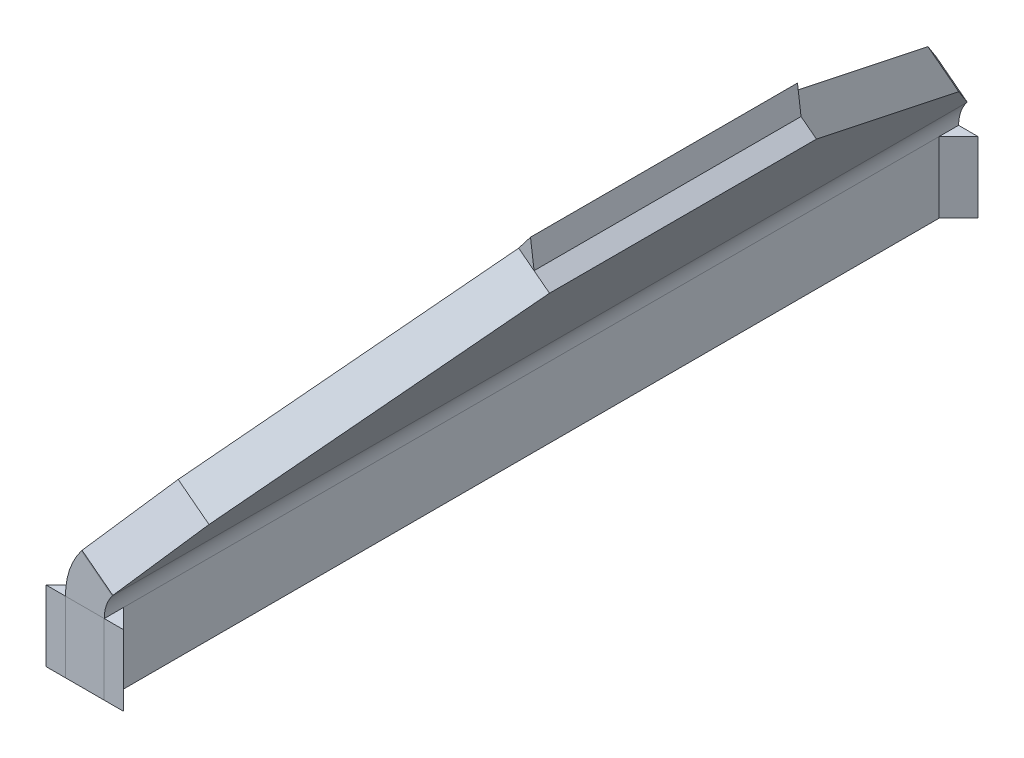
ISO-10303-21;
HEADER;
FILE_DESCRIPTION(('STEP AP214'),'2;1');
FILE_NAME('part.step','',(''),(''),'','','');
FILE_SCHEMA(('AUTOMOTIVE_DESIGN { 1 0 10303 214 1 1 1 1 }'));
ENDSEC;
DATA;
#1=APPLICATION_CONTEXT('core data for automotive mechanical design processes');
#2=APPLICATION_PROTOCOL_DEFINITION('international standard','automotive_design',2000,#1);
#3=PRODUCT_CONTEXT('',#1,'mechanical');
#4=PRODUCT('Part','Part','',(#3));
#5=PRODUCT_RELATED_PRODUCT_CATEGORY('part','',(#4));
#6=PRODUCT_DEFINITION_FORMATION('','',#4);
#7=PRODUCT_DEFINITION_CONTEXT('part definition',#1,'design');
#8=PRODUCT_DEFINITION('design','',#6,#7);
#9=PRODUCT_DEFINITION_SHAPE('','',#8);
#10=(LENGTH_UNIT() NAMED_UNIT(*) SI_UNIT(.MILLI.,.METRE.));
#11=(NAMED_UNIT(*) PLANE_ANGLE_UNIT() SI_UNIT($,.RADIAN.));
#12=(NAMED_UNIT(*) SI_UNIT($,.STERADIAN.) SOLID_ANGLE_UNIT());
#13=UNCERTAINTY_MEASURE_WITH_UNIT(LENGTH_MEASURE(1.E-05),#10,'distance_accuracy_value','');
#14=(GEOMETRIC_REPRESENTATION_CONTEXT(3) GLOBAL_UNCERTAINTY_ASSIGNED_CONTEXT((#13)) GLOBAL_UNIT_ASSIGNED_CONTEXT((#10,
#11,#12)) REPRESENTATION_CONTEXT('',''));
#15=CARTESIAN_POINT('',(0.,0.,0.));
#16=DIRECTION('',(0.,0.,1.));
#17=DIRECTION('',(1.,0.,0.));
#18=AXIS2_PLACEMENT_3D('',#15,#16,#17);
#19=CARTESIAN_POINT('',(0.,7.28436592909285,-42.));
#20=DIRECTION('',(-0.707106781186548,0.,0.707106781186547));
#21=DIRECTION('',(0.707106781186547,0.,0.707106781186548));
#22=AXIS2_PLACEMENT_3D('',#19,#20,#21);
#23=PLANE('',#22);
#24=DIRECTION('',(-0.707106781186547,0.,-0.707106781186548));
#25=VECTOR('',#24,1.);
#26=CARTESIAN_POINT('',(0.,-1.38777878078145E-13,-42.));
#27=LINE('',#26,#25);
#28=CARTESIAN_POINT('',(0.,-1.38777878078145E-13,-42.));
#29=VERTEX_POINT('',#28);
#30=CARTESIAN_POINT('',(-2.,0.,-44.));
#31=VERTEX_POINT('',#30);
#32=EDGE_CURVE('E108',#29,#31,#27,.T.);
#33=ORIENTED_EDGE('',*,*,#32,.F.);
#34=DIRECTION('',(0.,-1.,0.));
#35=VECTOR('',#34,1.);
#36=CARTESIAN_POINT('',(0.,7.28436592909285,-42.));
#37=LINE('',#36,#35);
#38=CARTESIAN_POINT('',(0.,7.28436592909285,-42.));
#39=VERTEX_POINT('',#38);
#40=EDGE_CURVE('E12',#39,#29,#37,.T.);
#41=ORIENTED_EDGE('',*,*,#40,.F.);
#42=DIRECTION('',(-0.707106781186547,0.,-0.707106781186548));
#43=VECTOR('',#42,1.);
#44=CARTESIAN_POINT('',(0.,7.28436592909285,-42.));
#45=LINE('',#44,#43);
#46=CARTESIAN_POINT('',(-1.99999999999999,7.28436592909298,-44.));
#47=VERTEX_POINT('',#46);
#48=EDGE_CURVE('E100',#39,#47,#45,.T.);
#49=ORIENTED_EDGE('',*,*,#48,.T.);
#50=DIRECTION('',(0.,-1.,0.));
#51=VECTOR('',#50,1.);
#52=CARTESIAN_POINT('',(-1.99999999999999,7.28436592909298,-44.));
#53=LINE('',#52,#51);
#54=EDGE_CURVE('E59',#47,#31,#53,.T.);
#55=ORIENTED_EDGE('',*,*,#54,.T.);
#56=EDGE_LOOP('',(#33,#41,#49,#55));
#57=FACE_BOUND('',#56,.T.);
#58=ADVANCED_FACE('F56',(#57),#23,.T.);
#59=CARTESIAN_POINT('',(0.,7.28436592909298,-44.));
#60=DIRECTION('',(1.,0.,0.));
#61=DIRECTION('',(0.,0.,-1.));
#62=AXIS2_PLACEMENT_3D('',#59,#60,#61);
#63=PLANE('',#62);
#64=DIRECTION('',(0.,0.,1.));
#65=VECTOR('',#64,1.);
#66=CARTESIAN_POINT('',(0.,-1.38777878078145E-13,-44.));
#67=LINE('',#66,#65);
#68=CARTESIAN_POINT('',(0.,-1.38777878078145E-13,-44.));
#69=VERTEX_POINT('',#68);
#70=EDGE_CURVE('E102',#69,#29,#67,.T.);
#71=ORIENTED_EDGE('',*,*,#70,.F.);
#72=DIRECTION('',(0.,-1.,0.));
#73=VECTOR('',#72,1.);
#74=CARTESIAN_POINT('',(0.,7.28436592909298,-44.));
#75=LINE('',#74,#73);
#76=CARTESIAN_POINT('',(0.,7.28436592909298,-44.));
#77=VERTEX_POINT('',#76);
#78=EDGE_CURVE('E65',#77,#69,#75,.T.);
#79=ORIENTED_EDGE('',*,*,#78,.F.);
#80=DIRECTION('',(0.,0.,1.));
#81=VECTOR('',#80,1.);
#82=CARTESIAN_POINT('',(0.,7.28436592909298,-44.));
#83=LINE('',#82,#81);
#84=EDGE_CURVE('E97',#77,#39,#83,.T.);
#85=ORIENTED_EDGE('',*,*,#84,.T.);
#86=ORIENTED_EDGE('',*,*,#40,.T.);
#87=EDGE_LOOP('',(#71,#79,#85,#86));
#88=FACE_BOUND('',#87,.T.);
#89=ADVANCED_FACE('F112',(#88),#63,.T.);
#90=CARTESIAN_POINT('',(-1.99999999999999,7.28436592909298,-44.));
#91=DIRECTION('',(0.,0.,-1.));
#92=DIRECTION('',(-1.,0.,0.));
#93=AXIS2_PLACEMENT_3D('',#90,#91,#92);
#94=PLANE('',#93);
#95=DIRECTION('',(1.,0.,0.));
#96=VECTOR('',#95,1.);
#97=CARTESIAN_POINT('',(-2.,0.,-44.));
#98=LINE('',#97,#96);
#99=EDGE_CURVE('E95',#31,#69,#98,.T.);
#100=ORIENTED_EDGE('',*,*,#99,.F.);
#101=ORIENTED_EDGE('',*,*,#54,.F.);
#102=DIRECTION('',(1.,0.,0.));
#103=VECTOR('',#102,1.);
#104=CARTESIAN_POINT('',(-1.99999999999999,7.28436592909298,-44.));
#105=LINE('',#104,#103);
#106=EDGE_CURVE('E93',#47,#77,#105,.T.);
#107=ORIENTED_EDGE('',*,*,#106,.T.);
#108=ORIENTED_EDGE('',*,*,#78,.T.);
#109=EDGE_LOOP('',(#100,#101,#107,#108));
#110=FACE_BOUND('',#109,.T.);
#111=ADVANCED_FACE('F92',(#110),#94,.T.);
#112=CARTESIAN_POINT('',(-1.99999999999999,7.28436592909298,-44.));
#113=DIRECTION('',(0.,-1.,0.));
#114=DIRECTION('',(0.,0.,-1.));
#115=AXIS2_PLACEMENT_3D('',#112,#113,#114);
#116=PLANE('',#115);
#117=ORIENTED_EDGE('',*,*,#48,.F.);
#118=ORIENTED_EDGE('',*,*,#84,.F.);
#119=ORIENTED_EDGE('',*,*,#106,.F.);
#120=EDGE_LOOP('',(#117,#118,#119));
#121=FACE_BOUND('',#120,.T.);
#122=ADVANCED_FACE('F99',(#121),#116,.F.);
#123=CARTESIAN_POINT('',(-2.,0.,-44.));
#124=DIRECTION('',(0.,-1.,0.));
#125=DIRECTION('',(0.,0.,-1.));
#126=AXIS2_PLACEMENT_3D('',#123,#124,#125);
#127=PLANE('',#126);
#128=ORIENTED_EDGE('',*,*,#32,.T.);
#129=ORIENTED_EDGE('',*,*,#99,.T.);
#130=ORIENTED_EDGE('',*,*,#70,.T.);
#131=EDGE_LOOP('',(#128,#129,#130));
#132=FACE_BOUND('',#131,.T.);
#133=ADVANCED_FACE('F111',(#132),#127,.T.);
#134=CLOSED_SHELL('',(#58,#89,#111,#122,#133));
#135=MANIFOLD_SOLID_BREP('B2',#134);
#136=CARTESIAN_POINT('',(6.,7.28436592909299,-43.9999999999999));
#137=DIRECTION('',(0.,0.,-1.));
#138=DIRECTION('',(-1.,0.,0.));
#139=AXIS2_PLACEMENT_3D('',#136,#137,#138);
#140=PLANE('',#139);
#141=DIRECTION('',(1.,0.,0.));
#142=VECTOR('',#141,1.);
#143=CARTESIAN_POINT('',(6.,0.,-44.));
#144=LINE('',#143,#142);
#145=CARTESIAN_POINT('',(4.,0.,-44.));
#146=VERTEX_POINT('',#145);
#147=CARTESIAN_POINT('',(6.,0.,-44.));
#148=VERTEX_POINT('',#147);
#149=EDGE_CURVE('E216',#146,#148,#144,.T.);
#150=ORIENTED_EDGE('',*,*,#149,.F.);
#151=DIRECTION('',(0.,-1.,0.));
#152=VECTOR('',#151,1.);
#153=CARTESIAN_POINT('',(4.,7.28436592909299,-43.9999999999999));
#154=LINE('',#153,#152);
#155=CARTESIAN_POINT('',(4.,7.28436592909299,-43.9999999999999));
#156=VERTEX_POINT('',#155);
#157=EDGE_CURVE('E54',#156,#146,#154,.T.);
#158=ORIENTED_EDGE('',*,*,#157,.F.);
#159=DIRECTION('',(1.,0.,0.));
#160=VECTOR('',#159,1.);
#161=CARTESIAN_POINT('',(6.,7.28436592909299,-43.9999999999999));
#162=LINE('',#161,#160);
#163=CARTESIAN_POINT('',(6.,7.28436592909299,-43.9999999999999));
#164=VERTEX_POINT('',#163);
#165=EDGE_CURVE('E208',#156,#164,#162,.T.);
#166=ORIENTED_EDGE('',*,*,#165,.T.);
#167=DIRECTION('',(0.,-1.,0.));
#168=VECTOR('',#167,1.);
#169=CARTESIAN_POINT('',(6.,7.28436592909299,-43.9999999999999));
#170=LINE('',#169,#168);
#171=EDGE_CURVE('E167',#164,#148,#170,.T.);
#172=ORIENTED_EDGE('',*,*,#171,.T.);
#173=EDGE_LOOP('',(#150,#158,#166,#172));
#174=FACE_BOUND('',#173,.T.);
#175=ADVANCED_FACE('F164',(#174),#140,.T.);
#176=CARTESIAN_POINT('',(4.,7.28436592909299,-43.9999999999999));
#177=DIRECTION('',(-1.,0.,0.));
#178=DIRECTION('',(0.,0.,1.));
#179=AXIS2_PLACEMENT_3D('',#176,#177,#178);
#180=PLANE('',#179);
#181=DIRECTION('',(0.,0.,-1.));
#182=VECTOR('',#181,1.);
#183=CARTESIAN_POINT('',(4.,0.,-44.));
#184=LINE('',#183,#182);
#185=CARTESIAN_POINT('',(4.,0.,-42.));
#186=VERTEX_POINT('',#185);
#187=EDGE_CURVE('E210',#186,#146,#184,.T.);
#188=ORIENTED_EDGE('',*,*,#187,.F.);
#189=DIRECTION('',(0.,-1.,0.));
#190=VECTOR('',#189,1.);
#191=CARTESIAN_POINT('',(4.,7.28436592909299,-41.9999999999999));
#192=LINE('',#191,#190);
#193=CARTESIAN_POINT('',(4.,7.28436592909299,-41.9999999999999));
#194=VERTEX_POINT('',#193);
#195=EDGE_CURVE('E173',#194,#186,#192,.T.);
#196=ORIENTED_EDGE('',*,*,#195,.F.);
#197=DIRECTION('',(0.,0.,-1.));
#198=VECTOR('',#197,1.);
#199=CARTESIAN_POINT('',(4.,7.28436592909299,-43.9999999999999));
#200=LINE('',#199,#198);
#201=EDGE_CURVE('E205',#194,#156,#200,.T.);
#202=ORIENTED_EDGE('',*,*,#201,.T.);
#203=ORIENTED_EDGE('',*,*,#157,.T.);
#204=EDGE_LOOP('',(#188,#196,#202,#203));
#205=FACE_BOUND('',#204,.T.);
#206=ADVANCED_FACE('F220',(#205),#180,.T.);
#207=CARTESIAN_POINT('',(4.,7.28436592909299,-41.9999999999999));
#208=DIRECTION('',(0.707106781186548,0.,0.707106781186548));
#209=DIRECTION('',(0.707106781186547,0.,-0.707106781186548));
#210=AXIS2_PLACEMENT_3D('',#207,#208,#209);
#211=PLANE('',#210);
#212=DIRECTION('',(-0.707106781186547,0.,0.707106781186548));
#213=VECTOR('',#212,1.);
#214=CARTESIAN_POINT('',(4.,0.,-42.));
#215=LINE('',#214,#213);
#216=EDGE_CURVE('E203',#148,#186,#215,.T.);
#217=ORIENTED_EDGE('',*,*,#216,.F.);
#218=ORIENTED_EDGE('',*,*,#171,.F.);
#219=DIRECTION('',(-0.707106781186547,0.,0.707106781186548));
#220=VECTOR('',#219,1.);
#221=CARTESIAN_POINT('',(4.,7.28436592909299,-41.9999999999999));
#222=LINE('',#221,#220);
#223=EDGE_CURVE('E201',#164,#194,#222,.T.);
#224=ORIENTED_EDGE('',*,*,#223,.T.);
#225=ORIENTED_EDGE('',*,*,#195,.T.);
#226=EDGE_LOOP('',(#217,#218,#224,#225));
#227=FACE_BOUND('',#226,.T.);
#228=ADVANCED_FACE('F200',(#227),#211,.T.);
#229=CARTESIAN_POINT('',(4.,7.28436592909299,-43.9999999999999));
#230=DIRECTION('',(0.,1.,0.));
#231=DIRECTION('',(0.,0.,1.));
#232=AXIS2_PLACEMENT_3D('',#229,#230,#231);
#233=PLANE('',#232);
#234=ORIENTED_EDGE('',*,*,#165,.F.);
#235=ORIENTED_EDGE('',*,*,#201,.F.);
#236=ORIENTED_EDGE('',*,*,#223,.F.);
#237=EDGE_LOOP('',(#234,#235,#236));
#238=FACE_BOUND('',#237,.T.);
#239=ADVANCED_FACE('F207',(#238),#233,.T.);
#240=CARTESIAN_POINT('',(4.,0.,-44.));
#241=DIRECTION('',(0.,1.,0.));
#242=DIRECTION('',(0.,0.,1.));
#243=AXIS2_PLACEMENT_3D('',#240,#241,#242);
#244=PLANE('',#243);
#245=ORIENTED_EDGE('',*,*,#149,.T.);
#246=ORIENTED_EDGE('',*,*,#216,.T.);
#247=ORIENTED_EDGE('',*,*,#187,.T.);
#248=EDGE_LOOP('',(#245,#246,#247));
#249=FACE_BOUND('',#248,.T.);
#250=ADVANCED_FACE('F219',(#249),#244,.F.);
#251=CLOSED_SHELL('',(#175,#206,#228,#239,#250));
#252=MANIFOLD_SOLID_BREP('B6',#251);
#253=CARTESIAN_POINT('',(3.99999999999999,7.28436592909299,42.));
#254=DIRECTION('',(0.707106781186548,0.,-0.707106781186548));
#255=DIRECTION('',(-0.707106781186547,0.,-0.707106781186548));
#256=AXIS2_PLACEMENT_3D('',#253,#254,#255);
#257=PLANE('',#256);
#258=DIRECTION('',(0.707106781186547,0.,0.707106781186548));
#259=VECTOR('',#258,1.);
#260=CARTESIAN_POINT('',(3.99999999999986,0.,42.));
#261=LINE('',#260,#259);
#262=CARTESIAN_POINT('',(3.99999999999986,0.,42.));
#263=VERTEX_POINT('',#262);
#264=CARTESIAN_POINT('',(5.99999999999986,0.,44.));
#265=VERTEX_POINT('',#264);
#266=EDGE_CURVE('E324',#263,#265,#261,.T.);
#267=ORIENTED_EDGE('',*,*,#266,.F.);
#268=DIRECTION('',(0.,-1.,0.));
#269=VECTOR('',#268,1.);
#270=CARTESIAN_POINT('',(3.99999999999999,7.28436592909299,42.));
#271=LINE('',#270,#269);
#272=CARTESIAN_POINT('',(3.99999999999999,7.28436592909299,42.));
#273=VERTEX_POINT('',#272);
#274=EDGE_CURVE('E162',#273,#263,#271,.T.);
#275=ORIENTED_EDGE('',*,*,#274,.F.);
#276=DIRECTION('',(0.707106781186547,0.,0.707106781186548));
#277=VECTOR('',#276,1.);
#278=CARTESIAN_POINT('',(3.99999999999999,7.28436592909299,42.));
#279=LINE('',#278,#277);
#280=CARTESIAN_POINT('',(5.99999999999999,7.28436592909299,44.));
#281=VERTEX_POINT('',#280);
#282=EDGE_CURVE('E316',#273,#281,#279,.T.);
#283=ORIENTED_EDGE('',*,*,#282,.T.);
#284=DIRECTION('',(0.,-1.,0.));
#285=VECTOR('',#284,1.);
#286=CARTESIAN_POINT('',(5.99999999999999,7.28436592909299,44.));
#287=LINE('',#286,#285);
#288=EDGE_CURVE('E275',#281,#265,#287,.T.);
#289=ORIENTED_EDGE('',*,*,#288,.T.);
#290=EDGE_LOOP('',(#267,#275,#283,#289));
#291=FACE_BOUND('',#290,.T.);
#292=ADVANCED_FACE('F272',(#291),#257,.T.);
#293=CARTESIAN_POINT('',(3.99999999999999,7.28436592909299,44.));
#294=DIRECTION('',(-1.,0.,0.));
#295=DIRECTION('',(0.,0.,1.));
#296=AXIS2_PLACEMENT_3D('',#293,#294,#295);
#297=PLANE('',#296);
#298=DIRECTION('',(0.,0.,-1.));
#299=VECTOR('',#298,1.);
#300=CARTESIAN_POINT('',(3.99999999999986,0.,44.));
#301=LINE('',#300,#299);
#302=CARTESIAN_POINT('',(3.99999999999986,0.,44.));
#303=VERTEX_POINT('',#302);
#304=EDGE_CURVE('E318',#303,#263,#301,.T.);
#305=ORIENTED_EDGE('',*,*,#304,.F.);
#306=DIRECTION('',(0.,-1.,0.));
#307=VECTOR('',#306,1.);
#308=CARTESIAN_POINT('',(3.99999999999999,7.28436592909299,44.));
#309=LINE('',#308,#307);
#310=CARTESIAN_POINT('',(3.99999999999999,7.28436592909299,44.));
#311=VERTEX_POINT('',#310);
#312=EDGE_CURVE('E281',#311,#303,#309,.T.);
#313=ORIENTED_EDGE('',*,*,#312,.F.);
#314=DIRECTION('',(0.,0.,-1.));
#315=VECTOR('',#314,1.);
#316=CARTESIAN_POINT('',(3.99999999999999,7.28436592909299,44.));
#317=LINE('',#316,#315);
#318=EDGE_CURVE('E313',#311,#273,#317,.T.);
#319=ORIENTED_EDGE('',*,*,#318,.T.);
#320=ORIENTED_EDGE('',*,*,#274,.T.);
#321=EDGE_LOOP('',(#305,#313,#319,#320));
#322=FACE_BOUND('',#321,.T.);
#323=ADVANCED_FACE('F328',(#322),#297,.T.);
#324=CARTESIAN_POINT('',(5.99999999999999,7.28436592909299,44.));
#325=DIRECTION('',(0.,0.,1.));
#326=DIRECTION('',(1.,0.,0.));
#327=AXIS2_PLACEMENT_3D('',#324,#325,#326);
#328=PLANE('',#327);
#329=DIRECTION('',(-1.,0.,0.));
#330=VECTOR('',#329,1.);
#331=CARTESIAN_POINT('',(5.99999999999986,0.,44.));
#332=LINE('',#331,#330);
#333=EDGE_CURVE('E311',#265,#303,#332,.T.);
#334=ORIENTED_EDGE('',*,*,#333,.F.);
#335=ORIENTED_EDGE('',*,*,#288,.F.);
#336=DIRECTION('',(-1.,0.,0.));
#337=VECTOR('',#336,1.);
#338=CARTESIAN_POINT('',(5.99999999999999,7.28436592909299,44.));
#339=LINE('',#338,#337);
#340=EDGE_CURVE('E309',#281,#311,#339,.T.);
#341=ORIENTED_EDGE('',*,*,#340,.T.);
#342=ORIENTED_EDGE('',*,*,#312,.T.);
#343=EDGE_LOOP('',(#334,#335,#341,#342));
#344=FACE_BOUND('',#343,.T.);
#345=ADVANCED_FACE('F308',(#344),#328,.T.);
#346=CARTESIAN_POINT('',(5.99999999999999,7.28436592909299,44.));
#347=DIRECTION('',(0.,-1.,0.));
#348=DIRECTION('',(0.,0.,-1.));
#349=AXIS2_PLACEMENT_3D('',#346,#347,#348);
#350=PLANE('',#349);
#351=ORIENTED_EDGE('',*,*,#282,.F.);
#352=ORIENTED_EDGE('',*,*,#318,.F.);
#353=ORIENTED_EDGE('',*,*,#340,.F.);
#354=EDGE_LOOP('',(#351,#352,#353));
#355=FACE_BOUND('',#354,.T.);
#356=ADVANCED_FACE('F315',(#355),#350,.F.);
#357=CARTESIAN_POINT('',(5.99999999999986,0.,44.));
#358=DIRECTION('',(0.,-1.,0.));
#359=DIRECTION('',(0.,0.,-1.));
#360=AXIS2_PLACEMENT_3D('',#357,#358,#359);
#361=PLANE('',#360);
#362=ORIENTED_EDGE('',*,*,#266,.T.);
#363=ORIENTED_EDGE('',*,*,#333,.T.);
#364=ORIENTED_EDGE('',*,*,#304,.T.);
#365=EDGE_LOOP('',(#362,#363,#364));
#366=FACE_BOUND('',#365,.T.);
#367=ADVANCED_FACE('F327',(#366),#361,.T.);
#368=CLOSED_SHELL('',(#292,#323,#345,#356,#367));
#369=MANIFOLD_SOLID_BREP('B48',#368);
#370=CARTESIAN_POINT('',(-2.,7.28436592909298,44.));
#371=DIRECTION('',(0.,0.,1.));
#372=DIRECTION('',(1.,0.,0.));
#373=AXIS2_PLACEMENT_3D('',#370,#371,#372);
#374=PLANE('',#373);
#375=DIRECTION('',(-1.,0.,0.));
#376=VECTOR('',#375,1.);
#377=CARTESIAN_POINT('',(-2.00000000000014,0.,44.));
#378=LINE('',#377,#376);
#379=CARTESIAN_POINT('',(-1.38777878078145E-13,0.,44.));
#380=VERTEX_POINT('',#379);
#381=CARTESIAN_POINT('',(-2.00000000000014,0.,44.));
#382=VERTEX_POINT('',#381);
#383=EDGE_CURVE('E432',#380,#382,#378,.T.);
#384=ORIENTED_EDGE('',*,*,#383,.F.);
#385=DIRECTION('',(0.,-1.,0.));
#386=VECTOR('',#385,1.);
#387=CARTESIAN_POINT('',(-1.38777878078145E-13,7.28436592909298,44.));
#388=LINE('',#387,#386);
#389=CARTESIAN_POINT('',(-1.38777878078145E-13,7.28436592909298,44.));
#390=VERTEX_POINT('',#389);
#391=EDGE_CURVE('E270',#390,#380,#388,.T.);
#392=ORIENTED_EDGE('',*,*,#391,.F.);
#393=DIRECTION('',(-1.,0.,0.));
#394=VECTOR('',#393,1.);
#395=CARTESIAN_POINT('',(-2.,7.28436592909298,44.));
#396=LINE('',#395,#394);
#397=CARTESIAN_POINT('',(-2.,7.28436592909298,44.));
#398=VERTEX_POINT('',#397);
#399=EDGE_CURVE('E424',#390,#398,#396,.T.);
#400=ORIENTED_EDGE('',*,*,#399,.T.);
#401=DIRECTION('',(0.,-1.,0.));
#402=VECTOR('',#401,1.);
#403=CARTESIAN_POINT('',(-2.,7.28436592909298,44.));
#404=LINE('',#403,#402);
#405=EDGE_CURVE('E383',#398,#382,#404,.T.);
#406=ORIENTED_EDGE('',*,*,#405,.T.);
#407=EDGE_LOOP('',(#384,#392,#400,#406));
#408=FACE_BOUND('',#407,.T.);
#409=ADVANCED_FACE('F380',(#408),#374,.T.);
#410=CARTESIAN_POINT('',(-1.38777878078145E-13,7.28436592909298,44.));
#411=DIRECTION('',(1.,0.,0.));
#412=DIRECTION('',(0.,0.,-1.));
#413=AXIS2_PLACEMENT_3D('',#410,#411,#412);
#414=PLANE('',#413);
#415=DIRECTION('',(0.,0.,1.));
#416=VECTOR('',#415,1.);
#417=CARTESIAN_POINT('',(-1.38777878078145E-13,0.,44.));
#418=LINE('',#417,#416);
#419=CARTESIAN_POINT('',(-1.38777878078145E-13,0.,42.));
#420=VERTEX_POINT('',#419);
#421=EDGE_CURVE('E426',#420,#380,#418,.T.);
#422=ORIENTED_EDGE('',*,*,#421,.F.);
#423=DIRECTION('',(0.,-1.,0.));
#424=VECTOR('',#423,1.);
#425=CARTESIAN_POINT('',(0.,7.28436592909298,42.));
#426=LINE('',#425,#424);
#427=CARTESIAN_POINT('',(0.,7.28436592909298,42.));
#428=VERTEX_POINT('',#427);
#429=EDGE_CURVE('E389',#428,#420,#426,.T.);
#430=ORIENTED_EDGE('',*,*,#429,.F.);
#431=DIRECTION('',(0.,0.,1.));
#432=VECTOR('',#431,1.);
#433=CARTESIAN_POINT('',(-1.38777878078145E-13,7.28436592909298,44.));
#434=LINE('',#433,#432);
#435=EDGE_CURVE('E421',#428,#390,#434,.T.);
#436=ORIENTED_EDGE('',*,*,#435,.T.);
#437=ORIENTED_EDGE('',*,*,#391,.T.);
#438=EDGE_LOOP('',(#422,#430,#436,#437));
#439=FACE_BOUND('',#438,.T.);
#440=ADVANCED_FACE('F436',(#439),#414,.T.);
#441=CARTESIAN_POINT('',(0.,7.28436592909298,42.));
#442=DIRECTION('',(-0.707106781186548,0.,-0.707106781186547));
#443=DIRECTION('',(-0.707106781186547,0.,0.707106781186548));
#444=AXIS2_PLACEMENT_3D('',#441,#442,#443);
#445=PLANE('',#444);
#446=DIRECTION('',(0.707106781186547,0.,-0.707106781186548));
#447=VECTOR('',#446,1.);
#448=CARTESIAN_POINT('',(-1.38777878078145E-13,0.,42.));
#449=LINE('',#448,#447);
#450=EDGE_CURVE('E419',#382,#420,#449,.T.);
#451=ORIENTED_EDGE('',*,*,#450,.F.);
#452=ORIENTED_EDGE('',*,*,#405,.F.);
#453=DIRECTION('',(0.707106781186547,0.,-0.707106781186548));
#454=VECTOR('',#453,1.);
#455=CARTESIAN_POINT('',(0.,7.28436592909298,42.));
#456=LINE('',#455,#454);
#457=EDGE_CURVE('E417',#398,#428,#456,.T.);
#458=ORIENTED_EDGE('',*,*,#457,.T.);
#459=ORIENTED_EDGE('',*,*,#429,.T.);
#460=EDGE_LOOP('',(#451,#452,#458,#459));
#461=FACE_BOUND('',#460,.T.);
#462=ADVANCED_FACE('F416',(#461),#445,.T.);
#463=CARTESIAN_POINT('',(-1.38777878078145E-13,7.28436592909298,44.));
#464=DIRECTION('',(0.,1.,0.));
#465=DIRECTION('',(0.,0.,1.));
#466=AXIS2_PLACEMENT_3D('',#463,#464,#465);
#467=PLANE('',#466);
#468=ORIENTED_EDGE('',*,*,#399,.F.);
#469=ORIENTED_EDGE('',*,*,#435,.F.);
#470=ORIENTED_EDGE('',*,*,#457,.F.);
#471=EDGE_LOOP('',(#468,#469,#470));
#472=FACE_BOUND('',#471,.T.);
#473=ADVANCED_FACE('F423',(#472),#467,.T.);
#474=CARTESIAN_POINT('',(-1.38777878078145E-13,0.,44.));
#475=DIRECTION('',(0.,1.,0.));
#476=DIRECTION('',(0.,0.,1.));
#477=AXIS2_PLACEMENT_3D('',#474,#475,#476);
#478=PLANE('',#477);
#479=ORIENTED_EDGE('',*,*,#383,.T.);
#480=ORIENTED_EDGE('',*,*,#450,.T.);
#481=ORIENTED_EDGE('',*,*,#421,.T.);
#482=EDGE_LOOP('',(#479,#480,#481));
#483=FACE_BOUND('',#482,.T.);
#484=ADVANCED_FACE('F435',(#483),#478,.F.);
#485=CLOSED_SHELL('',(#409,#440,#462,#473,#484));
#486=MANIFOLD_SOLID_BREP('B156',#485);
#487=CARTESIAN_POINT('',(17.6540814412529,33.0072468684458,-13.75));
#488=DIRECTION('',(-0.793353340291235,0.608761429008722,0.));
#489=DIRECTION('',(-0.608761429008722,-0.793353340291234,0.));
#490=AXIS2_PLACEMENT_3D('',#487,#488,#489);
#491=PLANE('',#490);
#492=DIRECTION('',(-0.608761429008722,-0.793353340291234,0.));
#493=VECTOR('',#492,1.);
#494=CARTESIAN_POINT('',(17.6540814412529,33.0072468684458,13.75));
#495=LINE('',#494,#493);
#496=CARTESIAN_POINT('',(17.6540814412529,33.0072468684458,13.75));
#497=VERTEX_POINT('',#496);
#498=CARTESIAN_POINT('',(16.4365585832355,31.4205401878633,13.75));
#499=VERTEX_POINT('',#498);
#500=EDGE_CURVE('E540',#497,#499,#495,.T.);
#501=ORIENTED_EDGE('',*,*,#500,.F.);
#502=DIRECTION('',(0.,0.,1.));
#503=VECTOR('',#502,1.);
#504=CARTESIAN_POINT('',(17.6540814412529,33.0072468684458,-13.75));
#505=LINE('',#504,#503);
#506=CARTESIAN_POINT('',(17.6540814412529,33.0072468684458,-13.75));
#507=VERTEX_POINT('',#506);
#508=EDGE_CURVE('E378',#507,#497,#505,.T.);
#509=ORIENTED_EDGE('',*,*,#508,.F.);
#510=DIRECTION('',(-0.608761429008722,-0.793353340291234,0.));
#511=VECTOR('',#510,1.);
#512=CARTESIAN_POINT('',(17.6540814412529,33.0072468684458,-13.75));
#513=LINE('',#512,#511);
#514=CARTESIAN_POINT('',(16.4365585832355,31.4205401878633,-13.75));
#515=VERTEX_POINT('',#514);
#516=EDGE_CURVE('E532',#507,#515,#513,.T.);
#517=ORIENTED_EDGE('',*,*,#516,.T.);
#518=DIRECTION('',(0.,0.,1.));
#519=VECTOR('',#518,1.);
#520=CARTESIAN_POINT('',(16.4365585832355,31.4205401878633,-13.75));
#521=LINE('',#520,#519);
#522=EDGE_CURVE('E491',#515,#499,#521,.T.);
#523=ORIENTED_EDGE('',*,*,#522,.T.);
#524=EDGE_LOOP('',(#501,#509,#517,#523));
#525=FACE_BOUND('',#524,.T.);
#526=ADVANCED_FACE('F488',(#525),#491,.T.);
#527=CARTESIAN_POINT('',(18.0232652638178,30.2030173298459,-13.75));
#528=DIRECTION('',(0.991444861373811,0.130526192220051,0.));
#529=DIRECTION('',(-0.13052619222005,0.99144486137381,0.));
#530=AXIS2_PLACEMENT_3D('',#527,#528,#529);
#531=PLANE('',#530);
#532=DIRECTION('',(-0.13052619222005,0.991444861373811,0.));
#533=VECTOR('',#532,1.);
#534=CARTESIAN_POINT('',(18.0232652638178,30.2030173298459,13.75));
#535=LINE('',#534,#533);
#536=CARTESIAN_POINT('',(18.0232652638178,30.2030173298459,13.75));
#537=VERTEX_POINT('',#536);
#538=EDGE_CURVE('E534',#537,#497,#535,.T.);
#539=ORIENTED_EDGE('',*,*,#538,.F.);
#540=DIRECTION('',(0.,0.,1.));
#541=VECTOR('',#540,1.);
#542=CARTESIAN_POINT('',(18.0232652638178,30.2030173298459,-13.75));
#543=LINE('',#542,#541);
#544=CARTESIAN_POINT('',(18.0232652638178,30.2030173298459,-13.75));
#545=VERTEX_POINT('',#544);
#546=EDGE_CURVE('E497',#545,#537,#543,.T.);
#547=ORIENTED_EDGE('',*,*,#546,.F.);
#548=DIRECTION('',(-0.13052619222005,0.991444861373811,0.));
#549=VECTOR('',#548,1.);
#550=CARTESIAN_POINT('',(18.0232652638178,30.2030173298459,-13.75));
#551=LINE('',#550,#549);
#552=EDGE_CURVE('E529',#545,#507,#551,.T.);
#553=ORIENTED_EDGE('',*,*,#552,.T.);
#554=ORIENTED_EDGE('',*,*,#508,.T.);
#555=EDGE_LOOP('',(#539,#547,#553,#554));
#556=FACE_BOUND('',#555,.T.);
#557=ADVANCED_FACE('F545',(#556),#531,.T.);
#558=CARTESIAN_POINT('',(16.4365585832355,31.4205401878633,-13.75));
#559=DIRECTION('',(-0.608761429008722,-0.793353340291235,0.));
#560=DIRECTION('',(0.793353340291234,-0.608761429008722,0.));
#561=AXIS2_PLACEMENT_3D('',#558,#559,#560);
#562=PLANE('',#561);
#563=DIRECTION('',(0.793353340291234,-0.608761429008722,0.));
#564=VECTOR('',#563,1.);
#565=CARTESIAN_POINT('',(16.4365585832355,31.4205401878633,13.75));
#566=LINE('',#565,#564);
#567=EDGE_CURVE('E527',#499,#537,#566,.T.);
#568=ORIENTED_EDGE('',*,*,#567,.F.);
#569=ORIENTED_EDGE('',*,*,#522,.F.);
#570=DIRECTION('',(0.793353340291234,-0.608761429008722,0.));
#571=VECTOR('',#570,1.);
#572=CARTESIAN_POINT('',(16.4365585832355,31.4205401878633,-13.75));
#573=LINE('',#572,#571);
#574=EDGE_CURVE('E525',#515,#545,#573,.T.);
#575=ORIENTED_EDGE('',*,*,#574,.T.);
#576=ORIENTED_EDGE('',*,*,#546,.T.);
#577=EDGE_LOOP('',(#568,#569,#575,#576));
#578=FACE_BOUND('',#577,.T.);
#579=ADVANCED_FACE('F524',(#578),#562,.T.);
#580=CARTESIAN_POINT('',(16.4365585832355,31.4205401878633,-13.75));
#581=DIRECTION('',(0.,0.,1.));
#582=DIRECTION('',(1.,0.,0.));
#583=AXIS2_PLACEMENT_3D('',#580,#581,#582);
#584=PLANE('',#583);
#585=ORIENTED_EDGE('',*,*,#516,.F.);
#586=ORIENTED_EDGE('',*,*,#552,.F.);
#587=ORIENTED_EDGE('',*,*,#574,.F.);
#588=EDGE_LOOP('',(#585,#586,#587));
#589=FACE_BOUND('',#588,.T.);
#590=ADVANCED_FACE('F531',(#589),#584,.F.);
#591=CARTESIAN_POINT('',(16.4365585832355,31.4205401878633,13.75));
#592=DIRECTION('',(0.,0.,1.));
#593=DIRECTION('',(1.,0.,0.));
#594=AXIS2_PLACEMENT_3D('',#591,#592,#593);
#595=PLANE('',#594);
#596=ORIENTED_EDGE('',*,*,#500,.T.);
#597=ORIENTED_EDGE('',*,*,#567,.T.);
#598=ORIENTED_EDGE('',*,*,#538,.T.);
#599=EDGE_LOOP('',(#596,#597,#598));
#600=FACE_BOUND('',#599,.T.);
#601=ADVANCED_FACE('F544',(#600),#595,.T.);
#602=CLOSED_SHELL('',(#526,#557,#579,#590,#601));
#603=MANIFOLD_SOLID_BREP('B264',#602);
#604=CARTESIAN_POINT('',(0.,7.28436592909298,-44.));
#605=DIRECTION('',(0.,0.,-1.));
#606=DIRECTION('',(-1.,0.,0.));
#607=AXIS2_PLACEMENT_3D('',#604,#605,#606);
#608=PLANE('',#607);
#609=DIRECTION('',(1.,0.,0.));
#610=VECTOR('',#609,1.);
#611=CARTESIAN_POINT('',(0.,7.28436592909298,-44.));
#612=LINE('',#611,#610);
#613=CARTESIAN_POINT('',(0.,7.28436592909298,-44.));
#614=VERTEX_POINT('',#613);
#615=CARTESIAN_POINT('',(4.,7.28436592909299,-43.9999999999999));
#616=VERTEX_POINT('',#615);
#617=EDGE_CURVE('E786',#614,#616,#612,.T.);
#618=ORIENTED_EDGE('',*,*,#617,.F.);
#619=CARTESIAN_POINT('',(8.,7.28436592909298,-43.9999999999999));
#620=DIRECTION('',(0.,0.,1.));
#621=DIRECTION('',(1.,0.,0.));
#622=AXIS2_PLACEMENT_3D('',#619,#620,#621);
#623=CIRCLE('',#622,8.);
#624=CARTESIAN_POINT('',(1.65317327767012,12.1544573611628,-43.9999999999999));
#625=VERTEX_POINT('',#624);
#626=EDGE_CURVE('E720',#614,#625,#623,.F.);
#627=ORIENTED_EDGE('',*,*,#626,.T.);
#628=DIRECTION('',(-0.793353340291234,0.608761429008722,0.));
#629=VECTOR('',#628,1.);
#630=CARTESIAN_POINT('',(4.82658663883506,9.71941164512788,-43.9999999999999));
#631=LINE('',#630,#629);
#632=CARTESIAN_POINT('',(4.82658663883506,9.71941164512788,-43.9999999999999));
#633=VERTEX_POINT('',#632);
#634=EDGE_CURVE('E784',#633,#625,#631,.T.);
#635=ORIENTED_EDGE('',*,*,#634,.F.);
#636=CARTESIAN_POINT('',(8.,7.28436592909298,-43.9999999999999));
#637=DIRECTION('',(0.,0.,1.));
#638=DIRECTION('',(1.,0.,0.));
#639=AXIS2_PLACEMENT_3D('',#636,#637,#638);
#640=CIRCLE('',#639,4.);
#641=EDGE_CURVE('E733',#616,#633,#640,.F.);
#642=ORIENTED_EDGE('',*,*,#641,.F.);
#643=EDGE_LOOP('',(#618,#627,#635,#642));
#644=FACE_BOUND('',#643,.T.);
#645=ADVANCED_FACE('F586',(#644),#608,.T.);
#646=CARTESIAN_POINT('',(4.82658663883506,9.71941164512788,-43.9999999999999));
#647=DIRECTION('',(0.,0.,-1.));
#648=DIRECTION('',(-1.,0.,0.));
#649=AXIS2_PLACEMENT_3D('',#646,#647,#648);
#650=PLANE('',#649);
#651=DIRECTION('',(0.,1.,0.));
#652=VECTOR('',#651,1.);
#653=CARTESIAN_POINT('',(0.,-1.38777878078145E-13,-44.));
#654=LINE('',#653,#652);
#655=CARTESIAN_POINT('',(0.,-1.38777878078145E-13,-44.));
#656=VERTEX_POINT('',#655);
#657=EDGE_CURVE('E724',#656,#614,#654,.T.);
#658=ORIENTED_EDGE('',*,*,#657,.T.);
#659=ORIENTED_EDGE('',*,*,#617,.T.);
#660=DIRECTION('',(0.,1.,0.));
#661=VECTOR('',#660,1.);
#662=CARTESIAN_POINT('',(4.,0.,-44.));
#663=LINE('',#662,#661);
#664=CARTESIAN_POINT('',(4.,0.,-44.));
#665=VERTEX_POINT('',#664);
#666=EDGE_CURVE('E729',#665,#616,#663,.T.);
#667=ORIENTED_EDGE('',*,*,#666,.F.);
#668=DIRECTION('',(-1.,0.,0.));
#669=VECTOR('',#668,1.);
#670=CARTESIAN_POINT('',(4.,0.,-44.));
#671=LINE('',#670,#669);
#672=EDGE_CURVE('E727',#665,#656,#671,.T.);
#673=ORIENTED_EDGE('',*,*,#672,.T.);
#674=EDGE_LOOP('',(#658,#659,#667,#673));
#675=FACE_BOUND('',#674,.T.);
#676=ADVANCED_FACE('F833',(#675),#650,.T.);
#677=CARTESIAN_POINT('',(1.65317327766999,12.1544573611628,44.));
#678=DIRECTION('',(0.,0.,1.));
#679=DIRECTION('',(1.,0.,0.));
#680=AXIS2_PLACEMENT_3D('',#677,#678,#679);
#681=PLANE('',#680);
#682=DIRECTION('',(0.793353340291234,-0.608761429008722,0.));
#683=VECTOR('',#682,1.);
#684=CARTESIAN_POINT('',(1.65317327766999,12.1544573611628,44.));
#685=LINE('',#684,#683);
#686=CARTESIAN_POINT('',(1.65317327766999,12.1544573611628,44.));
#687=VERTEX_POINT('',#686);
#688=CARTESIAN_POINT('',(4.82658663883506,9.71941164512788,44.));
#689=VERTEX_POINT('',#688);
#690=EDGE_CURVE('E782',#687,#689,#685,.T.);
#691=ORIENTED_EDGE('',*,*,#690,.F.);
#692=CARTESIAN_POINT('',(7.99999999999999,7.28436592909298,44.));
#693=DIRECTION('',(0.,0.,1.));
#694=DIRECTION('',(1.,0.,0.));
#695=AXIS2_PLACEMENT_3D('',#692,#693,#694);
#696=CIRCLE('',#695,8.);
#697=CARTESIAN_POINT('',(-1.38777878078145E-13,7.28436592909298,44.));
#698=VERTEX_POINT('',#697);
#699=EDGE_CURVE('E742',#698,#687,#696,.F.);
#700=ORIENTED_EDGE('',*,*,#699,.F.);
#701=DIRECTION('',(-1.,0.,0.));
#702=VECTOR('',#701,1.);
#703=CARTESIAN_POINT('',(3.99999999999999,7.28436592909299,44.));
#704=LINE('',#703,#702);
#705=CARTESIAN_POINT('',(3.99999999999999,7.28436592909299,44.));
#706=VERTEX_POINT('',#705);
#707=EDGE_CURVE('E759',#706,#698,#704,.T.);
#708=ORIENTED_EDGE('',*,*,#707,.F.);
#709=CARTESIAN_POINT('',(7.99999999999999,7.28436592909298,44.));
#710=DIRECTION('',(0.,0.,1.));
#711=DIRECTION('',(1.,0.,0.));
#712=AXIS2_PLACEMENT_3D('',#709,#710,#711);
#713=CIRCLE('',#712,4.);
#714=EDGE_CURVE('E717',#706,#689,#713,.F.);
#715=ORIENTED_EDGE('',*,*,#714,.T.);
#716=EDGE_LOOP('',(#691,#700,#708,#715));
#717=FACE_BOUND('',#716,.T.);
#718=ADVANCED_FACE('F806',(#717),#681,.T.);
#719=CARTESIAN_POINT('',(3.99999999999999,7.28436592909299,44.));
#720=DIRECTION('',(0.,0.,1.));
#721=DIRECTION('',(1.,0.,0.));
#722=AXIS2_PLACEMENT_3D('',#719,#720,#721);
#723=PLANE('',#722);
#724=DIRECTION('',(0.793353340291234,-0.608761429008722,0.));
#725=VECTOR('',#724,1.);
#726=CARTESIAN_POINT('',(-8.63233202493516,20.1706660661783,44.));
#727=LINE('',#726,#725);
#728=CARTESIAN_POINT('',(1.71299446532488,12.2324178507481,44.));
#729=VERTEX_POINT('',#728);
#730=CARTESIAN_POINT('',(4.88640782648995,9.79737213471323,44.));
#731=VERTEX_POINT('',#730);
#732=EDGE_CURVE('E707',#729,#731,#727,.T.);
#733=ORIENTED_EDGE('',*,*,#732,.F.);
#734=DIRECTION('',(0.608761429008722,0.793353340291234,0.));
#735=VECTOR('',#734,1.);
#736=CARTESIAN_POINT('',(0.,9.99999999999999,44.));
#737=LINE('',#736,#735);
#738=EDGE_CURVE('E738',#687,#729,#737,.T.);
#739=ORIENTED_EDGE('',*,*,#738,.F.);
#740=ORIENTED_EDGE('',*,*,#690,.T.);
#741=DIRECTION('',(0.608761429008722,0.793353340291234,0.));
#742=VECTOR('',#741,1.);
#743=CARTESIAN_POINT('',(3.17341336116493,7.56495428396512,44.));
#744=LINE('',#743,#742);
#745=EDGE_CURVE('E714',#689,#731,#744,.T.);
#746=ORIENTED_EDGE('',*,*,#745,.T.);
#747=EDGE_LOOP('',(#733,#739,#740,#746));
#748=FACE_BOUND('',#747,.T.);
#749=ADVANCED_FACE('F802',(#748),#723,.T.);
#750=CARTESIAN_POINT('',(3.17341336116494,7.56495428396511,-43.9999999999999));
#751=DIRECTION('',(0.793353340291234,-0.608761429008722,0.));
#752=DIRECTION('',(0.608761429008722,0.793353340291234,0.));
#753=AXIS2_PLACEMENT_3D('',#750,#751,#752);
#754=PLANE('',#753);
#755=DIRECTION('',(-0.340415071008387,-0.443637557835669,-0.829037572555043));
#756=VECTOR('',#755,1.);
#757=CARTESIAN_POINT('',(9.40157315606063,15.6816501547827,-38.6112557783922));
#758=LINE('',#757,#756);
#759=CARTESIAN_POINT('',(19.6099719444004,28.9854944718284,-13.75));
#760=VERTEX_POINT('',#759);
#761=CARTESIAN_POINT('',(9.40157315606063,15.6816501547827,-38.6112557783922));
#762=VERTEX_POINT('',#761);
#763=EDGE_CURVE('E682',#760,#762,#758,.T.);
#764=ORIENTED_EDGE('',*,*,#763,.F.);
#765=DIRECTION('',(0.,0.,1.));
#766=VECTOR('',#765,1.);
#767=CARTESIAN_POINT('',(19.6099719444004,28.9854944718284,-44.));
#768=LINE('',#767,#766);
#769=CARTESIAN_POINT('',(19.6099719444004,28.9854944718284,13.75));
#770=VERTEX_POINT('',#769);
#771=EDGE_CURVE('E607',#760,#770,#768,.T.);
#772=ORIENTED_EDGE('',*,*,#771,.T.);
#773=DIRECTION('',(0.340415071008387,0.443637557835669,-0.829037572555043));
#774=VECTOR('',#773,1.);
#775=CARTESIAN_POINT('',(19.6099719444004,28.9854944718284,13.75));
#776=LINE('',#775,#774);
#777=CARTESIAN_POINT('',(9.40157315606049,15.6816501547827,38.6112557783922));
#778=VERTEX_POINT('',#777);
#779=EDGE_CURVE('E705',#778,#770,#776,.T.);
#780=ORIENTED_EDGE('',*,*,#779,.F.);
#781=DIRECTION('',(0.492498341588034,0.641836334839739,-0.587785252292473));
#782=VECTOR('',#781,1.);
#783=CARTESIAN_POINT('',(4.88640782648995,9.79737213471323,44.));
#784=LINE('',#783,#782);
#785=EDGE_CURVE('E702',#731,#778,#784,.T.);
#786=ORIENTED_EDGE('',*,*,#785,.F.);
#787=ORIENTED_EDGE('',*,*,#745,.F.);
#788=DIRECTION('',(0.,0.,1.));
#789=VECTOR('',#788,1.);
#790=CARTESIAN_POINT('',(4.82658663883506,9.71941164512788,-43.9999999999999));
#791=LINE('',#790,#789);
#792=EDGE_CURVE('E755',#633,#689,#791,.T.);
#793=ORIENTED_EDGE('',*,*,#792,.F.);
#794=DIRECTION('',(0.608761429008722,0.793353340291234,0.));
#795=VECTOR('',#794,1.);
#796=CARTESIAN_POINT('',(3.17341336116494,7.56495428396511,-43.9999999999999));
#797=LINE('',#796,#795);
#798=CARTESIAN_POINT('',(4.88640782648996,9.79737213471323,-43.9999999999999));
#799=VERTEX_POINT('',#798);
#800=EDGE_CURVE('E691',#633,#799,#797,.T.);
#801=ORIENTED_EDGE('',*,*,#800,.T.);
#802=DIRECTION('',(-0.492498341588034,-0.641836334839739,-0.587785252292473));
#803=VECTOR('',#802,1.);
#804=CARTESIAN_POINT('',(4.88640782648996,9.79737213471323,-43.9999999999999));
#805=LINE('',#804,#803);
#806=EDGE_CURVE('E600',#762,#799,#805,.T.);
#807=ORIENTED_EDGE('',*,*,#806,.F.);
#808=EDGE_LOOP('',(#764,#772,#780,#786,#787,#793,#801,#807));
#809=FACE_BOUND('',#808,.T.);
#810=ADVANCED_FACE('F688',(#809),#754,.T.);
#811=CARTESIAN_POINT('',(8.,7.28436592909298,-43.9999999999999));
#812=DIRECTION('',(0.,0.,1.));
#813=DIRECTION('',(1.,0.,0.));
#814=AXIS2_PLACEMENT_3D('',#811,#812,#813);
#815=CYLINDRICAL_SURFACE('',#814,4.);
#816=ORIENTED_EDGE('',*,*,#714,.F.);
#817=DIRECTION('',(0.,0.,1.));
#818=VECTOR('',#817,1.);
#819=CARTESIAN_POINT('',(4.,7.28436592909299,-43.9999999999999));
#820=LINE('',#819,#818);
#821=EDGE_CURVE('E760',#616,#706,#820,.T.);
#822=ORIENTED_EDGE('',*,*,#821,.F.);
#823=ORIENTED_EDGE('',*,*,#641,.T.);
#824=ORIENTED_EDGE('',*,*,#792,.T.);
#825=EDGE_LOOP('',(#816,#822,#823,#824));
#826=FACE_BOUND('',#825,.T.);
#827=ADVANCED_FACE('F810',(#826),#815,.F.);
#828=CARTESIAN_POINT('',(4.,0.,-44.));
#829=DIRECTION('',(1.,0.,0.));
#830=DIRECTION('',(0.,0.,-1.));
#831=AXIS2_PLACEMENT_3D('',#828,#829,#830);
#832=PLANE('',#831);
#833=DIRECTION('',(0.,1.,0.));
#834=VECTOR('',#833,1.);
#835=CARTESIAN_POINT('',(3.99999999999986,0.,44.));
#836=LINE('',#835,#834);
#837=CARTESIAN_POINT('',(3.99999999999986,0.,44.));
#838=VERTEX_POINT('',#837);
#839=EDGE_CURVE('E750',#838,#706,#836,.T.);
#840=ORIENTED_EDGE('',*,*,#839,.F.);
#841=DIRECTION('',(0.,0.,1.));
#842=VECTOR('',#841,1.);
#843=CARTESIAN_POINT('',(4.,0.,-44.));
#844=LINE('',#843,#842);
#845=EDGE_CURVE('E764',#665,#838,#844,.T.);
#846=ORIENTED_EDGE('',*,*,#845,.F.);
#847=ORIENTED_EDGE('',*,*,#666,.T.);
#848=ORIENTED_EDGE('',*,*,#821,.T.);
#849=EDGE_LOOP('',(#840,#846,#847,#848));
#850=FACE_BOUND('',#849,.T.);
#851=ADVANCED_FACE('F862',(#850),#832,.T.);
#852=CARTESIAN_POINT('',(4.,0.,-44.));
#853=DIRECTION('',(0.,1.,0.));
#854=DIRECTION('',(0.,0.,1.));
#855=AXIS2_PLACEMENT_3D('',#852,#853,#854);
#856=PLANE('',#855);
#857=DIRECTION('',(-1.,0.,0.));
#858=VECTOR('',#857,1.);
#859=CARTESIAN_POINT('',(3.99999999999986,0.,44.));
#860=LINE('',#859,#858);
#861=CARTESIAN_POINT('',(-1.38777878078145E-13,0.,44.));
#862=VERTEX_POINT('',#861);
#863=EDGE_CURVE('E748',#838,#862,#860,.T.);
#864=ORIENTED_EDGE('',*,*,#863,.T.);
#865=DIRECTION('',(0.,0.,1.));
#866=VECTOR('',#865,1.);
#867=CARTESIAN_POINT('',(0.,-1.38777878078145E-13,-44.));
#868=LINE('',#867,#866);
#869=EDGE_CURVE('E766',#656,#862,#868,.T.);
#870=ORIENTED_EDGE('',*,*,#869,.F.);
#871=ORIENTED_EDGE('',*,*,#672,.F.);
#872=ORIENTED_EDGE('',*,*,#845,.T.);
#873=EDGE_LOOP('',(#864,#870,#871,#872));
#874=FACE_BOUND('',#873,.T.);
#875=ADVANCED_FACE('F858',(#874),#856,.F.);
#876=CARTESIAN_POINT('',(0.,-1.38777878078145E-13,-44.));
#877=DIRECTION('',(1.,0.,0.));
#878=DIRECTION('',(0.,0.,-1.));
#879=AXIS2_PLACEMENT_3D('',#876,#877,#878);
#880=PLANE('',#879);
#881=DIRECTION('',(0.,1.,0.));
#882=VECTOR('',#881,1.);
#883=CARTESIAN_POINT('',(-1.38777878078145E-13,0.,44.));
#884=LINE('',#883,#882);
#885=EDGE_CURVE('E745',#862,#698,#884,.T.);
#886=ORIENTED_EDGE('',*,*,#885,.T.);
#887=DIRECTION('',(0.,0.,1.));
#888=VECTOR('',#887,1.);
#889=CARTESIAN_POINT('',(0.,7.28436592909298,-44.));
#890=LINE('',#889,#888);
#891=EDGE_CURVE('E769',#614,#698,#890,.T.);
#892=ORIENTED_EDGE('',*,*,#891,.F.);
#893=ORIENTED_EDGE('',*,*,#657,.F.);
#894=ORIENTED_EDGE('',*,*,#869,.T.);
#895=EDGE_LOOP('',(#886,#892,#893,#894));
#896=FACE_BOUND('',#895,.T.);
#897=ADVANCED_FACE('F854',(#896),#880,.F.);
#898=CARTESIAN_POINT('',(8.,7.28436592909298,-43.9999999999999));
#899=DIRECTION('',(0.,0.,1.));
#900=DIRECTION('',(1.,0.,0.));
#901=AXIS2_PLACEMENT_3D('',#898,#899,#900);
#902=CYLINDRICAL_SURFACE('',#901,8.);
#903=ORIENTED_EDGE('',*,*,#699,.T.);
#904=DIRECTION('',(0.,0.,1.));
#905=VECTOR('',#904,1.);
#906=CARTESIAN_POINT('',(1.65317327767012,12.1544573611628,-43.9999999999999));
#907=LINE('',#906,#905);
#908=EDGE_CURVE('E773',#625,#687,#907,.T.);
#909=ORIENTED_EDGE('',*,*,#908,.F.);
#910=ORIENTED_EDGE('',*,*,#626,.F.);
#911=ORIENTED_EDGE('',*,*,#891,.T.);
#912=EDGE_LOOP('',(#903,#909,#910,#911));
#913=FACE_BOUND('',#912,.T.);
#914=ADVANCED_FACE('F851',(#913),#902,.T.);
#915=CARTESIAN_POINT('',(0.,10.,-43.9999999999999));
#916=DIRECTION('',(0.793353340291234,-0.608761429008722,0.));
#917=DIRECTION('',(0.608761429008722,0.793353340291234,0.));
#918=AXIS2_PLACEMENT_3D('',#915,#916,#917);
#919=PLANE('',#918);
#920=DIRECTION('',(0.,0.,1.));
#921=VECTOR('',#920,1.);
#922=CARTESIAN_POINT('',(16.4365585832355,31.4205401878635,-44.));
#923=LINE('',#922,#921);
#924=CARTESIAN_POINT('',(16.4365585832355,31.4205401878633,-13.75));
#925=VERTEX_POINT('',#924);
#926=CARTESIAN_POINT('',(16.4365585832355,31.4205401878633,13.75));
#927=VERTEX_POINT('',#926);
#928=EDGE_CURVE('E777',#925,#927,#923,.T.);
#929=ORIENTED_EDGE('',*,*,#928,.F.);
#930=DIRECTION('',(-0.340415071008387,-0.443637557835669,-0.829037572555043));
#931=VECTOR('',#930,1.);
#932=CARTESIAN_POINT('',(2.75984015586023,13.5966937161033,-47.0579067620673));
#933=LINE('',#932,#931);
#934=CARTESIAN_POINT('',(6.22815979489569,18.1166958708175,-38.6112557783922));
#935=VERTEX_POINT('',#934);
#936=EDGE_CURVE('E700',#925,#935,#933,.T.);
#937=ORIENTED_EDGE('',*,*,#936,.T.);
#938=DIRECTION('',(-0.492498341588034,-0.641836334839739,-0.587785252292473));
#939=VECTOR('',#938,1.);
#940=CARTESIAN_POINT('',(0.59182503213482,10.7712813981605,-45.3380894969623));
#941=LINE('',#940,#939);
#942=CARTESIAN_POINT('',(1.71299446532502,12.2324178507481,-43.9999999999999));
#943=VERTEX_POINT('',#942);
#944=EDGE_CURVE('E677',#935,#943,#941,.T.);
#945=ORIENTED_EDGE('',*,*,#944,.T.);
#946=DIRECTION('',(0.608761429008722,0.793353340291234,0.));
#947=VECTOR('',#946,1.);
#948=CARTESIAN_POINT('',(0.,10.,-43.9999999999999));
#949=LINE('',#948,#947);
#950=EDGE_CURVE('E716',#625,#943,#949,.T.);
#951=ORIENTED_EDGE('',*,*,#950,.F.);
#952=ORIENTED_EDGE('',*,*,#908,.T.);
#953=ORIENTED_EDGE('',*,*,#738,.T.);
#954=DIRECTION('',(0.492498341588034,0.641836334839739,-0.587785252292473));
#955=VECTOR('',#954,1.);
#956=CARTESIAN_POINT('',(26.066352084962,43.9703314145347,14.9348372494602));
#957=LINE('',#956,#955);
#958=CARTESIAN_POINT('',(6.22815979489556,18.1166958708175,38.6112557783922));
#959=VERTEX_POINT('',#958);
#960=EDGE_CURVE('E593',#729,#959,#957,.T.);
#961=ORIENTED_EDGE('',*,*,#960,.T.);
#962=DIRECTION('',(0.340415071008387,0.443637557835669,-0.829037572555043));
#963=VECTOR('',#962,1.);
#964=CARTESIAN_POINT('',(27.5949259592956,45.9624076718284,-13.424783348233));
#965=LINE('',#964,#963);
#966=EDGE_CURVE('E710',#959,#927,#965,.T.);
#967=ORIENTED_EDGE('',*,*,#966,.T.);
#968=EDGE_LOOP('',(#929,#937,#945,#951,#952,#953,#961,#967));
#969=FACE_BOUND('',#968,.T.);
#970=ADVANCED_FACE('F794',(#969),#919,.F.);
#971=CARTESIAN_POINT('',(16.4365585832355,31.4205401878635,-44.));
#972=DIRECTION('',(-0.608761429008722,-0.793353340291234,0.));
#973=DIRECTION('',(0.793353340291234,-0.608761429008722,0.));
#974=AXIS2_PLACEMENT_3D('',#971,#972,#973);
#975=PLANE('',#974);
#976=ORIENTED_EDGE('',*,*,#771,.F.);
#977=DIRECTION('',(0.793353340291234,-0.608761429008722,0.));
#978=VECTOR('',#977,1.);
#979=CARTESIAN_POINT('',(6.09123209297544,39.3587884032933,-13.75));
#980=LINE('',#979,#978);
#981=EDGE_CURVE('E680',#925,#760,#980,.T.);
#982=ORIENTED_EDGE('',*,*,#981,.F.);
#983=ORIENTED_EDGE('',*,*,#928,.T.);
#984=DIRECTION('',(0.793353340291234,-0.608761429008722,0.));
#985=VECTOR('',#984,1.);
#986=CARTESIAN_POINT('',(16.4365585832355,31.4205401878633,13.75));
#987=LINE('',#986,#985);
#988=EDGE_CURVE('E789',#927,#770,#987,.T.);
#989=ORIENTED_EDGE('',*,*,#988,.T.);
#990=EDGE_LOOP('',(#976,#982,#983,#989));
#991=FACE_BOUND('',#990,.T.);
#992=ADVANCED_FACE('F819',(#991),#975,.F.);
#993=CARTESIAN_POINT('',(8.,7.28436592909298,-43.9999999999999));
#994=DIRECTION('',(0.,0.,1.));
#995=DIRECTION('',(1.,0.,0.));
#996=AXIS2_PLACEMENT_3D('',#993,#994,#995);
#997=PLANE('',#996);
#998=ORIENTED_EDGE('',*,*,#950,.T.);
#999=DIRECTION('',(0.793353340291234,-0.608761429008722,0.));
#1000=VECTOR('',#999,1.);
#1001=CARTESIAN_POINT('',(8.05982118765491,7.36232641867834,-43.9999999999999));
#1002=LINE('',#1001,#1000);
#1003=EDGE_CURVE('E486',#943,#799,#1002,.T.);
#1004=ORIENTED_EDGE('',*,*,#1003,.T.);
#1005=ORIENTED_EDGE('',*,*,#800,.F.);
#1006=ORIENTED_EDGE('',*,*,#634,.T.);
#1007=EDGE_LOOP('',(#998,#1004,#1005,#1006));
#1008=FACE_BOUND('',#1007,.T.);
#1009=ADVANCED_FACE('F816',(#1008),#997,.F.);
#1010=CARTESIAN_POINT('',(7.99999999999999,7.28436592909298,44.));
#1011=DIRECTION('',(0.,0.,1.));
#1012=DIRECTION('',(1.,0.,0.));
#1013=AXIS2_PLACEMENT_3D('',#1010,#1011,#1012);
#1014=PLANE('',#1013);
#1015=ORIENTED_EDGE('',*,*,#839,.T.);
#1016=ORIENTED_EDGE('',*,*,#707,.T.);
#1017=ORIENTED_EDGE('',*,*,#885,.F.);
#1018=ORIENTED_EDGE('',*,*,#863,.F.);
#1019=EDGE_LOOP('',(#1015,#1016,#1017,#1018));
#1020=FACE_BOUND('',#1019,.T.);
#1021=ADVANCED_FACE('F830',(#1020),#1014,.T.);
#1022=CARTESIAN_POINT('',(-8.63233202493516,20.1706660661783,44.));
#1023=DIRECTION('',(-0.357820990135818,-0.46632139328016,-0.809016994374947));
#1024=DIRECTION('',(0.,0.866379828921387,-0.49938561456869));
#1025=AXIS2_PLACEMENT_3D('',#1022,#1023,#1024);
#1026=PLANE('',#1025);
#1027=ORIENTED_EDGE('',*,*,#732,.T.);
#1028=ORIENTED_EDGE('',*,*,#785,.T.);
#1029=DIRECTION('',(0.793353340291234,-0.608761429008722,0.));
#1030=VECTOR('',#1029,1.);
#1031=CARTESIAN_POINT('',(-4.11716669536435,26.0549440862477,38.6112557783922));
#1032=LINE('',#1031,#1030);
#1033=EDGE_CURVE('E708',#959,#778,#1032,.T.);
#1034=ORIENTED_EDGE('',*,*,#1033,.F.);
#1035=ORIENTED_EDGE('',*,*,#960,.F.);
#1036=EDGE_LOOP('',(#1027,#1028,#1034,#1035));
#1037=FACE_BOUND('',#1036,.T.);
#1038=ADVANCED_FACE('F799',(#1037),#1026,.F.);
#1039=CARTESIAN_POINT('',(6.09123209297544,39.3587884032935,13.75));
#1040=DIRECTION('',(-0.50468609737053,-0.65771972741348,-0.559192903470745));
#1041=DIRECTION('',(0.,0.647736601167623,-0.761864355057916));
#1042=AXIS2_PLACEMENT_3D('',#1039,#1040,#1041);
#1043=PLANE('',#1042);
#1044=ORIENTED_EDGE('',*,*,#1033,.T.);
#1045=ORIENTED_EDGE('',*,*,#779,.T.);
#1046=ORIENTED_EDGE('',*,*,#988,.F.);
#1047=ORIENTED_EDGE('',*,*,#966,.F.);
#1048=EDGE_LOOP('',(#1044,#1045,#1046,#1047));
#1049=FACE_BOUND('',#1048,.T.);
#1050=ADVANCED_FACE('F822',(#1049),#1043,.F.);
#1051=CARTESIAN_POINT('',(-4.11716669536435,26.0549440862477,-38.6112557783922));
#1052=DIRECTION('',(-0.50468609737053,-0.65771972741348,0.559192903470745));
#1053=DIRECTION('',(0.,-0.647736601167623,-0.761864355057916));
#1054=AXIS2_PLACEMENT_3D('',#1051,#1052,#1053);
#1055=PLANE('',#1054);
#1056=ORIENTED_EDGE('',*,*,#981,.T.);
#1057=ORIENTED_EDGE('',*,*,#763,.T.);
#1058=DIRECTION('',(0.793353340291234,-0.608761429008722,0.));
#1059=VECTOR('',#1058,1.);
#1060=CARTESIAN_POINT('',(-4.11716669536435,26.0549440862477,-38.6112557783922));
#1061=LINE('',#1060,#1059);
#1062=EDGE_CURVE('E673',#935,#762,#1061,.T.);
#1063=ORIENTED_EDGE('',*,*,#1062,.F.);
#1064=ORIENTED_EDGE('',*,*,#936,.F.);
#1065=EDGE_LOOP('',(#1056,#1057,#1063,#1064));
#1066=FACE_BOUND('',#1065,.T.);
#1067=ADVANCED_FACE('F683',(#1066),#1055,.F.);
#1068=CARTESIAN_POINT('',(-8.63233202493503,20.1706660661783,-43.9999999999999));
#1069=DIRECTION('',(-0.357820990135818,-0.46632139328016,0.809016994374947));
#1070=DIRECTION('',(0.,-0.866379828921387,-0.49938561456869));
#1071=AXIS2_PLACEMENT_3D('',#1068,#1069,#1070);
#1072=PLANE('',#1071);
#1073=ORIENTED_EDGE('',*,*,#1062,.T.);
#1074=ORIENTED_EDGE('',*,*,#806,.T.);
#1075=ORIENTED_EDGE('',*,*,#1003,.F.);
#1076=ORIENTED_EDGE('',*,*,#944,.F.);
#1077=EDGE_LOOP('',(#1073,#1074,#1075,#1076));
#1078=FACE_BOUND('',#1077,.T.);
#1079=ADVANCED_FACE('F675',(#1078),#1072,.F.);
#1080=CLOSED_SHELL('',(#645,#676,#718,#749,#810,#827,#851,#875,#897,#914,#970,#992,#1009,#1021,
#1038,#1050,#1067,#1079));
#1081=MANIFOLD_SOLID_BREP('B372',#1080);
#1082=ADVANCED_BREP_SHAPE_REPRESENTATION('',(#18,#135,#252,#369,#486,#603,#1081),#14);
#1083=SHAPE_DEFINITION_REPRESENTATION(#9,#1082);
ENDSEC;
END-ISO-10303-21;
